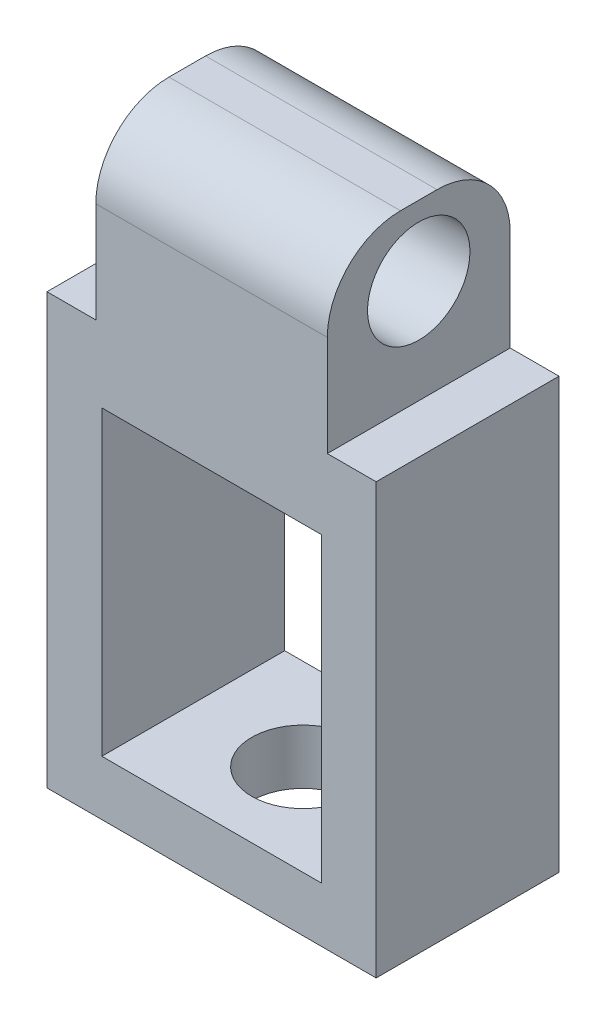
ISO-10303-21;
HEADER;
FILE_DESCRIPTION(('STEP AP214'),'2;1');
FILE_NAME('part.step','',(''),(''),'','','');
FILE_SCHEMA(('AUTOMOTIVE_DESIGN { 1 0 10303 214 1 1 1 1 }'));
ENDSEC;
DATA;
#1=APPLICATION_CONTEXT('core data for automotive mechanical design processes');
#2=APPLICATION_PROTOCOL_DEFINITION('international standard','automotive_design',2000,#1);
#3=PRODUCT_CONTEXT('',#1,'mechanical');
#4=PRODUCT('Part','Part','',(#3));
#5=PRODUCT_RELATED_PRODUCT_CATEGORY('part','',(#4));
#6=PRODUCT_DEFINITION_FORMATION('','',#4);
#7=PRODUCT_DEFINITION_CONTEXT('part definition',#1,'design');
#8=PRODUCT_DEFINITION('design','',#6,#7);
#9=PRODUCT_DEFINITION_SHAPE('','',#8);
#10=(LENGTH_UNIT() NAMED_UNIT(*) SI_UNIT(.MILLI.,.METRE.));
#11=(NAMED_UNIT(*) PLANE_ANGLE_UNIT() SI_UNIT($,.RADIAN.));
#12=(NAMED_UNIT(*) SI_UNIT($,.STERADIAN.) SOLID_ANGLE_UNIT());
#13=UNCERTAINTY_MEASURE_WITH_UNIT(LENGTH_MEASURE(1.E-05),#10,'distance_accuracy_value','');
#14=(GEOMETRIC_REPRESENTATION_CONTEXT(3) GLOBAL_UNCERTAINTY_ASSIGNED_CONTEXT((#13)) GLOBAL_UNIT_ASSIGNED_CONTEXT((#10,
#11,#12)) REPRESENTATION_CONTEXT('',''));
#15=CARTESIAN_POINT('',(0.,0.,0.));
#16=DIRECTION('',(0.,0.,1.));
#17=DIRECTION('',(1.,0.,0.));
#18=AXIS2_PLACEMENT_3D('',#15,#16,#17);
#19=CARTESIAN_POINT('',(-12.3630857788911,11.2393364752563,5.));
#20=DIRECTION('',(0.,0.,-1.));
#21=DIRECTION('',(-1.,0.,0.));
#22=AXIS2_PLACEMENT_3D('',#19,#20,#21);
#23=PLANE('',#22);
#24=DIRECTION('',(0.,1.,0.));
#25=VECTOR('',#24,1.);
#26=CARTESIAN_POINT('',(-6.03308577889106,11.2393364752563,5.));
#27=LINE('',#26,#25);
#28=CARTESIAN_POINT('',(-6.03308577889106,6.48933647525632,5.));
#29=VERTEX_POINT('',#28);
#30=CARTESIAN_POINT('',(-6.03308577889106,9.23933647525632,5.));
#31=VERTEX_POINT('',#30);
#32=EDGE_CURVE('E196',#29,#31,#27,.T.);
#33=ORIENTED_EDGE('',*,*,#32,.T.);
#34=DIRECTION('',(-1.,0.,0.));
#35=VECTOR('',#34,1.);
#36=CARTESIAN_POINT('',(-12.3630857788911,9.23933647525632,5.));
#37=LINE('',#36,#35);
#38=CARTESIAN_POINT('',(-12.3630857788911,9.23933647525632,5.));
#39=VERTEX_POINT('',#38);
#40=EDGE_CURVE('E11',#31,#39,#37,.T.);
#41=ORIENTED_EDGE('',*,*,#40,.T.);
#42=DIRECTION('',(0.,-1.,0.));
#43=VECTOR('',#42,1.);
#44=CARTESIAN_POINT('',(-12.3630857788911,6.48933647525632,5.));
#45=LINE('',#44,#43);
#46=CARTESIAN_POINT('',(-12.3630857788911,6.48933647525632,5.));
#47=VERTEX_POINT('',#46);
#48=EDGE_CURVE('E183',#39,#47,#45,.T.);
#49=ORIENTED_EDGE('',*,*,#48,.T.);
#50=DIRECTION('',(-1.,0.,0.));
#51=VECTOR('',#50,1.);
#52=CARTESIAN_POINT('',(-13.6980857788911,6.48933647525632,5.));
#53=LINE('',#52,#51);
#54=CARTESIAN_POINT('',(-13.6980857788911,6.48933647525632,5.));
#55=VERTEX_POINT('',#54);
#56=EDGE_CURVE('E185',#47,#55,#53,.T.);
#57=ORIENTED_EDGE('',*,*,#56,.T.);
#58=DIRECTION('',(0.,-1.,0.));
#59=VECTOR('',#58,1.);
#60=CARTESIAN_POINT('',(-13.6980857788911,-5.26066352474368,5.));
#61=LINE('',#60,#59);
#62=CARTESIAN_POINT('',(-13.6980857788911,-5.26066352474368,5.));
#63=VERTEX_POINT('',#62);
#64=EDGE_CURVE('E188',#55,#63,#61,.T.);
#65=ORIENTED_EDGE('',*,*,#64,.T.);
#66=DIRECTION('',(1.,0.,0.));
#67=VECTOR('',#66,1.);
#68=CARTESIAN_POINT('',(-4.69808577889106,-5.26066352474368,5.));
#69=LINE('',#68,#67);
#70=CARTESIAN_POINT('',(-4.69808577889106,-5.26066352474368,5.));
#71=VERTEX_POINT('',#70);
#72=EDGE_CURVE('E190',#63,#71,#69,.T.);
#73=ORIENTED_EDGE('',*,*,#72,.T.);
#74=DIRECTION('',(0.,1.,0.));
#75=VECTOR('',#74,1.);
#76=CARTESIAN_POINT('',(-4.69808577889106,6.48933647525632,5.));
#77=LINE('',#76,#75);
#78=CARTESIAN_POINT('',(-4.69808577889106,6.48933647525632,5.));
#79=VERTEX_POINT('',#78);
#80=EDGE_CURVE('E192',#71,#79,#77,.T.);
#81=ORIENTED_EDGE('',*,*,#80,.T.);
#82=DIRECTION('',(-1.,0.,0.));
#83=VECTOR('',#82,1.);
#84=CARTESIAN_POINT('',(-6.03308577889106,6.48933647525632,5.));
#85=LINE('',#84,#83);
#86=EDGE_CURVE('E194',#79,#29,#85,.T.);
#87=ORIENTED_EDGE('',*,*,#86,.T.);
#88=EDGE_LOOP('',(#33,#41,#49,#57,#65,#73,#81,#87));
#89=FACE_BOUND('',#88,.T.);
#90=DIRECTION('',(0.,-1.,0.));
#91=VECTOR('',#90,1.);
#92=CARTESIAN_POINT('',(-12.1980857788911,4.48933647525632,5.));
#93=LINE('',#92,#91);
#94=CARTESIAN_POINT('',(-12.1980857788911,4.48933647525632,5.));
#95=VERTEX_POINT('',#94);
#96=CARTESIAN_POINT('',(-12.1980857788911,-3.76066352474368,5.));
#97=VERTEX_POINT('',#96);
#98=EDGE_CURVE('E150',#95,#97,#93,.T.);
#99=ORIENTED_EDGE('',*,*,#98,.F.);
#100=DIRECTION('',(-1.,0.,0.));
#101=VECTOR('',#100,1.);
#102=CARTESIAN_POINT('',(-9.19808577889106,4.48933647525632,5.));
#103=LINE('',#102,#101);
#104=CARTESIAN_POINT('',(-6.19808577889106,4.48933647525632,5.));
#105=VERTEX_POINT('',#104);
#106=EDGE_CURVE('E139',#105,#95,#103,.T.);
#107=ORIENTED_EDGE('',*,*,#106,.F.);
#108=DIRECTION('',(0.,1.,0.));
#109=VECTOR('',#108,1.);
#110=CARTESIAN_POINT('',(-6.19808577889106,-3.76066352474368,5.));
#111=LINE('',#110,#109);
#112=CARTESIAN_POINT('',(-6.19808577889106,-3.76066352474368,5.));
#113=VERTEX_POINT('',#112);
#114=EDGE_CURVE('E165',#113,#105,#111,.T.);
#115=ORIENTED_EDGE('',*,*,#114,.F.);
#116=DIRECTION('',(1.,0.,0.));
#117=VECTOR('',#116,1.);
#118=CARTESIAN_POINT('',(-12.1980857788911,-3.76066352474368,5.));
#119=LINE('',#118,#117);
#120=EDGE_CURVE('E163',#97,#113,#119,.T.);
#121=ORIENTED_EDGE('',*,*,#120,.F.);
#122=EDGE_LOOP('',(#99,#107,#115,#121));
#123=FACE_BOUND('',#122,.T.);
#124=ADVANCED_FACE('F35',(#89,#123),#23,.F.);
#125=CARTESIAN_POINT('',(-12.3630857788911,11.2393364752563,0.));
#126=DIRECTION('',(0.,0.,-1.));
#127=DIRECTION('',(-1.,0.,0.));
#128=AXIS2_PLACEMENT_3D('',#125,#126,#127);
#129=PLANE('',#128);
#130=DIRECTION('',(0.,-1.,0.));
#131=VECTOR('',#130,1.);
#132=CARTESIAN_POINT('',(-12.3630857788911,6.48933647525632,0.));
#133=LINE('',#132,#131);
#134=CARTESIAN_POINT('',(-12.3630857788911,9.23933647525632,0.));
#135=VERTEX_POINT('',#134);
#136=CARTESIAN_POINT('',(-12.3630857788911,6.48933647525632,0.));
#137=VERTEX_POINT('',#136);
#138=EDGE_CURVE('E159',#135,#137,#133,.T.);
#139=ORIENTED_EDGE('',*,*,#138,.F.);
#140=DIRECTION('',(-1.,0.,0.));
#141=VECTOR('',#140,1.);
#142=CARTESIAN_POINT('',(-6.03308577889106,9.23933647525632,0.));
#143=LINE('',#142,#141);
#144=CARTESIAN_POINT('',(-6.03308577889106,9.23933647525632,0.));
#145=VERTEX_POINT('',#144);
#146=EDGE_CURVE('E58',#135,#145,#143,.F.);
#147=ORIENTED_EDGE('',*,*,#146,.T.);
#148=DIRECTION('',(0.,1.,0.));
#149=VECTOR('',#148,1.);
#150=CARTESIAN_POINT('',(-6.03308577889106,11.2393364752563,0.));
#151=LINE('',#150,#149);
#152=CARTESIAN_POINT('',(-6.03308577889106,6.48933647525632,0.));
#153=VERTEX_POINT('',#152);
#154=EDGE_CURVE('E186',#153,#145,#151,.T.);
#155=ORIENTED_EDGE('',*,*,#154,.F.);
#156=DIRECTION('',(-1.,0.,0.));
#157=VECTOR('',#156,1.);
#158=CARTESIAN_POINT('',(-6.03308577889106,6.48933647525632,0.));
#159=LINE('',#158,#157);
#160=CARTESIAN_POINT('',(-4.69808577889106,6.48933647525632,0.));
#161=VERTEX_POINT('',#160);
#162=EDGE_CURVE('E208',#161,#153,#159,.T.);
#163=ORIENTED_EDGE('',*,*,#162,.F.);
#164=DIRECTION('',(0.,1.,0.));
#165=VECTOR('',#164,1.);
#166=CARTESIAN_POINT('',(-4.69808577889106,6.48933647525632,0.));
#167=LINE('',#166,#165);
#168=CARTESIAN_POINT('',(-4.69808577889106,-5.26066352474368,0.));
#169=VERTEX_POINT('',#168);
#170=EDGE_CURVE('E206',#169,#161,#167,.T.);
#171=ORIENTED_EDGE('',*,*,#170,.F.);
#172=DIRECTION('',(1.,0.,0.));
#173=VECTOR('',#172,1.);
#174=CARTESIAN_POINT('',(-4.69808577889106,-5.26066352474368,0.));
#175=LINE('',#174,#173);
#176=CARTESIAN_POINT('',(-13.6980857788911,-5.26066352474368,0.));
#177=VERTEX_POINT('',#176);
#178=EDGE_CURVE('E204',#177,#169,#175,.T.);
#179=ORIENTED_EDGE('',*,*,#178,.F.);
#180=DIRECTION('',(0.,-1.,0.));
#181=VECTOR('',#180,1.);
#182=CARTESIAN_POINT('',(-13.6980857788911,-5.26066352474368,0.));
#183=LINE('',#182,#181);
#184=CARTESIAN_POINT('',(-13.6980857788911,6.48933647525632,0.));
#185=VERTEX_POINT('',#184);
#186=EDGE_CURVE('E202',#185,#177,#183,.T.);
#187=ORIENTED_EDGE('',*,*,#186,.F.);
#188=DIRECTION('',(-1.,0.,0.));
#189=VECTOR('',#188,1.);
#190=CARTESIAN_POINT('',(-13.6980857788911,6.48933647525632,0.));
#191=LINE('',#190,#189);
#192=EDGE_CURVE('E200',#137,#185,#191,.T.);
#193=ORIENTED_EDGE('',*,*,#192,.F.);
#194=EDGE_LOOP('',(#139,#147,#155,#163,#171,#179,#187,#193));
#195=FACE_BOUND('',#194,.T.);
#196=DIRECTION('',(-1.,0.,0.));
#197=VECTOR('',#196,1.);
#198=CARTESIAN_POINT('',(-9.19808577889106,4.48933647525632,0.));
#199=LINE('',#198,#197);
#200=CARTESIAN_POINT('',(-6.19808577889106,4.48933647525632,0.));
#201=VERTEX_POINT('',#200);
#202=CARTESIAN_POINT('',(-12.1980857788911,4.48933647525632,0.));
#203=VERTEX_POINT('',#202);
#204=EDGE_CURVE('E151',#201,#203,#199,.T.);
#205=ORIENTED_EDGE('',*,*,#204,.T.);
#206=DIRECTION('',(0.,-1.,0.));
#207=VECTOR('',#206,1.);
#208=CARTESIAN_POINT('',(-12.1980857788911,4.48933647525632,0.));
#209=LINE('',#208,#207);
#210=CARTESIAN_POINT('',(-12.1980857788911,-3.76066352474368,0.));
#211=VERTEX_POINT('',#210);
#212=EDGE_CURVE('E157',#203,#211,#209,.T.);
#213=ORIENTED_EDGE('',*,*,#212,.T.);
#214=DIRECTION('',(1.,0.,0.));
#215=VECTOR('',#214,1.);
#216=CARTESIAN_POINT('',(-12.1980857788911,-3.76066352474368,0.));
#217=LINE('',#216,#215);
#218=CARTESIAN_POINT('',(-6.19808577889106,-3.76066352474368,0.));
#219=VERTEX_POINT('',#218);
#220=EDGE_CURVE('E171',#211,#219,#217,.T.);
#221=ORIENTED_EDGE('',*,*,#220,.T.);
#222=DIRECTION('',(0.,1.,0.));
#223=VECTOR('',#222,1.);
#224=CARTESIAN_POINT('',(-6.19808577889106,-3.76066352474368,0.));
#225=LINE('',#224,#223);
#226=EDGE_CURVE('E175',#219,#201,#225,.T.);
#227=ORIENTED_EDGE('',*,*,#226,.T.);
#228=EDGE_LOOP('',(#205,#213,#221,#227));
#229=FACE_BOUND('',#228,.T.);
#230=ADVANCED_FACE('F262',(#195,#229),#129,.T.);
#231=CARTESIAN_POINT('',(-12.3630857788911,6.48933647525632,5.));
#232=DIRECTION('',(1.,0.,0.));
#233=DIRECTION('',(0.,0.,-1.));
#234=AXIS2_PLACEMENT_3D('',#231,#232,#233);
#235=PLANE('',#234);
#236=CARTESIAN_POINT('',(-12.3630857788911,9.32350258781156,2.5));
#237=DIRECTION('',(1.,0.,0.));
#238=DIRECTION('',(0.,0.,-1.));
#239=AXIS2_PLACEMENT_3D('',#236,#237,#238);
#240=CIRCLE('',#239,1.4);
#241=CARTESIAN_POINT('',(-12.3630857788911,9.32350258781156,1.1));
#242=VERTEX_POINT('',#241);
#243=EDGE_CURVE('E172',#242,#242,#240,.T.);
#244=ORIENTED_EDGE('',*,*,#243,.T.);
#245=EDGE_LOOP('',(#244));
#246=FACE_BOUND('',#245,.T.);
#247=DIRECTION('',(0.,0.,-1.));
#248=VECTOR('',#247,1.);
#249=CARTESIAN_POINT('',(-12.3630857788911,11.2393364752563,5.));
#250=LINE('',#249,#248);
#251=CARTESIAN_POINT('',(-12.3630857788911,11.2393364752563,3.));
#252=VERTEX_POINT('',#251);
#253=CARTESIAN_POINT('',(-12.3630857788911,11.2393364752563,2.));
#254=VERTEX_POINT('',#253);
#255=EDGE_CURVE('E198',#252,#254,#250,.T.);
#256=ORIENTED_EDGE('',*,*,#255,.T.);
#257=CARTESIAN_POINT('',(-12.3630857788911,9.23933647525632,2.));
#258=DIRECTION('',(1.,0.,0.));
#259=DIRECTION('',(0.,0.,-1.));
#260=AXIS2_PLACEMENT_3D('',#257,#258,#259);
#261=CIRCLE('',#260,2.);
#262=EDGE_CURVE('E246',#254,#135,#261,.F.);
#263=ORIENTED_EDGE('',*,*,#262,.T.);
#264=ORIENTED_EDGE('',*,*,#138,.T.);
#265=DIRECTION('',(0.,0.,-1.));
#266=VECTOR('',#265,1.);
#267=CARTESIAN_POINT('',(-12.3630857788911,6.48933647525632,5.));
#268=LINE('',#267,#266);
#269=EDGE_CURVE('E231',#47,#137,#268,.T.);
#270=ORIENTED_EDGE('',*,*,#269,.F.);
#271=ORIENTED_EDGE('',*,*,#48,.F.);
#272=CARTESIAN_POINT('',(-12.3630857788911,9.23933647525632,3.));
#273=DIRECTION('',(1.,0.,0.));
#274=DIRECTION('',(0.,0.,-1.));
#275=AXIS2_PLACEMENT_3D('',#272,#273,#274);
#276=CIRCLE('',#275,2.);
#277=EDGE_CURVE('E244',#39,#252,#276,.F.);
#278=ORIENTED_EDGE('',*,*,#277,.T.);
#279=EDGE_LOOP('',(#256,#263,#264,#270,#271,#278));
#280=FACE_BOUND('',#279,.T.);
#281=ADVANCED_FACE('F259',(#246,#280),#235,.F.);
#282=CARTESIAN_POINT('',(-13.6980857788911,6.48933647525632,5.));
#283=DIRECTION('',(0.,-1.,0.));
#284=DIRECTION('',(0.,0.,-1.));
#285=AXIS2_PLACEMENT_3D('',#282,#283,#284);
#286=PLANE('',#285);
#287=ORIENTED_EDGE('',*,*,#192,.T.);
#288=DIRECTION('',(0.,0.,-1.));
#289=VECTOR('',#288,1.);
#290=CARTESIAN_POINT('',(-13.6980857788911,6.48933647525632,5.));
#291=LINE('',#290,#289);
#292=EDGE_CURVE('E228',#55,#185,#291,.T.);
#293=ORIENTED_EDGE('',*,*,#292,.F.);
#294=ORIENTED_EDGE('',*,*,#56,.F.);
#295=ORIENTED_EDGE('',*,*,#269,.T.);
#296=EDGE_LOOP('',(#287,#293,#294,#295));
#297=FACE_BOUND('',#296,.T.);
#298=ADVANCED_FACE('F269',(#297),#286,.F.);
#299=CARTESIAN_POINT('',(-13.6980857788911,-5.26066352474368,5.));
#300=DIRECTION('',(1.,0.,0.));
#301=DIRECTION('',(0.,1.,0.));
#302=AXIS2_PLACEMENT_3D('',#299,#300,#301);
#303=PLANE('',#302);
#304=ORIENTED_EDGE('',*,*,#186,.T.);
#305=DIRECTION('',(0.,0.,-1.));
#306=VECTOR('',#305,1.);
#307=CARTESIAN_POINT('',(-13.6980857788911,-5.26066352474368,5.));
#308=LINE('',#307,#306);
#309=EDGE_CURVE('E225',#63,#177,#308,.T.);
#310=ORIENTED_EDGE('',*,*,#309,.F.);
#311=ORIENTED_EDGE('',*,*,#64,.F.);
#312=ORIENTED_EDGE('',*,*,#292,.T.);
#313=EDGE_LOOP('',(#304,#310,#311,#312));
#314=FACE_BOUND('',#313,.T.);
#315=ADVANCED_FACE('F304',(#314),#303,.F.);
#316=CARTESIAN_POINT('',(-4.69808577889106,-5.26066352474368,5.));
#317=DIRECTION('',(0.,1.,0.));
#318=DIRECTION('',(-1.,0.,0.));
#319=AXIS2_PLACEMENT_3D('',#316,#317,#318);
#320=PLANE('',#319);
#321=CARTESIAN_POINT('',(-9.19808577889106,-5.26066352474368,2.5));
#322=DIRECTION('',(0.,-1.,0.));
#323=DIRECTION('',(1.,0.,0.));
#324=AXIS2_PLACEMENT_3D('',#321,#322,#323);
#325=CIRCLE('',#324,1.4);
#326=CARTESIAN_POINT('',(-7.79808577889106,-5.26066352474368,2.5));
#327=VERTEX_POINT('',#326);
#328=EDGE_CURVE('E239',#327,#327,#325,.T.);
#329=ORIENTED_EDGE('',*,*,#328,.F.);
#330=EDGE_LOOP('',(#329));
#331=FACE_BOUND('',#330,.T.);
#332=ORIENTED_EDGE('',*,*,#178,.T.);
#333=DIRECTION('',(0.,0.,-1.));
#334=VECTOR('',#333,1.);
#335=CARTESIAN_POINT('',(-4.69808577889106,-5.26066352474368,5.));
#336=LINE('',#335,#334);
#337=EDGE_CURVE('E222',#71,#169,#336,.T.);
#338=ORIENTED_EDGE('',*,*,#337,.F.);
#339=ORIENTED_EDGE('',*,*,#72,.F.);
#340=ORIENTED_EDGE('',*,*,#309,.T.);
#341=EDGE_LOOP('',(#332,#338,#339,#340));
#342=FACE_BOUND('',#341,.T.);
#343=ADVANCED_FACE('F300',(#331,#342),#320,.F.);
#344=CARTESIAN_POINT('',(-4.69808577889106,6.48933647525632,5.));
#345=DIRECTION('',(-1.,0.,0.));
#346=DIRECTION('',(0.,-1.,0.));
#347=AXIS2_PLACEMENT_3D('',#344,#345,#346);
#348=PLANE('',#347);
#349=ORIENTED_EDGE('',*,*,#170,.T.);
#350=DIRECTION('',(0.,0.,-1.));
#351=VECTOR('',#350,1.);
#352=CARTESIAN_POINT('',(-4.69808577889106,6.48933647525632,5.));
#353=LINE('',#352,#351);
#354=EDGE_CURVE('E219',#79,#161,#353,.T.);
#355=ORIENTED_EDGE('',*,*,#354,.F.);
#356=ORIENTED_EDGE('',*,*,#80,.F.);
#357=ORIENTED_EDGE('',*,*,#337,.T.);
#358=EDGE_LOOP('',(#349,#355,#356,#357));
#359=FACE_BOUND('',#358,.T.);
#360=ADVANCED_FACE('F296',(#359),#348,.F.);
#361=CARTESIAN_POINT('',(-6.03308577889106,6.48933647525632,5.));
#362=DIRECTION('',(0.,-1.,0.));
#363=DIRECTION('',(1.,0.,0.));
#364=AXIS2_PLACEMENT_3D('',#361,#362,#363);
#365=PLANE('',#364);
#366=ORIENTED_EDGE('',*,*,#162,.T.);
#367=DIRECTION('',(0.,0.,-1.));
#368=VECTOR('',#367,1.);
#369=CARTESIAN_POINT('',(-6.03308577889106,6.48933647525632,5.));
#370=LINE('',#369,#368);
#371=EDGE_CURVE('E216',#29,#153,#370,.T.);
#372=ORIENTED_EDGE('',*,*,#371,.F.);
#373=ORIENTED_EDGE('',*,*,#86,.F.);
#374=ORIENTED_EDGE('',*,*,#354,.T.);
#375=EDGE_LOOP('',(#366,#372,#373,#374));
#376=FACE_BOUND('',#375,.T.);
#377=ADVANCED_FACE('F292',(#376),#365,.F.);
#378=CARTESIAN_POINT('',(-6.03308577889106,11.2393364752563,5.));
#379=DIRECTION('',(-1.,0.,0.));
#380=DIRECTION('',(0.,-1.,0.));
#381=AXIS2_PLACEMENT_3D('',#378,#379,#380);
#382=PLANE('',#381);
#383=CARTESIAN_POINT('',(-6.03308577889106,9.32350258781156,2.5));
#384=DIRECTION('',(1.,0.,0.));
#385=DIRECTION('',(0.,0.,-1.));
#386=AXIS2_PLACEMENT_3D('',#383,#384,#385);
#387=CIRCLE('',#386,1.4);
#388=CARTESIAN_POINT('',(-6.03308577889106,9.32350258781156,1.1));
#389=VERTEX_POINT('',#388);
#390=EDGE_CURVE('E238',#389,#389,#387,.T.);
#391=ORIENTED_EDGE('',*,*,#390,.F.);
#392=EDGE_LOOP('',(#391));
#393=FACE_BOUND('',#392,.T.);
#394=ORIENTED_EDGE('',*,*,#154,.T.);
#395=CARTESIAN_POINT('',(-6.03308577889106,9.23933647525632,2.));
#396=DIRECTION('',(-1.,0.,0.));
#397=DIRECTION('',(0.,-1.,0.));
#398=AXIS2_PLACEMENT_3D('',#395,#396,#397);
#399=CIRCLE('',#398,2.);
#400=CARTESIAN_POINT('',(-6.03308577889106,11.2393364752563,2.));
#401=VERTEX_POINT('',#400);
#402=EDGE_CURVE('E43',#145,#401,#399,.F.);
#403=ORIENTED_EDGE('',*,*,#402,.T.);
#404=DIRECTION('',(0.,0.,-1.));
#405=VECTOR('',#404,1.);
#406=CARTESIAN_POINT('',(-6.03308577889106,11.2393364752563,5.));
#407=LINE('',#406,#405);
#408=CARTESIAN_POINT('',(-6.03308577889106,11.2393364752563,3.));
#409=VERTEX_POINT('',#408);
#410=EDGE_CURVE('E213',#409,#401,#407,.T.);
#411=ORIENTED_EDGE('',*,*,#410,.F.);
#412=CARTESIAN_POINT('',(-6.03308577889106,9.23933647525632,3.));
#413=DIRECTION('',(-1.,0.,0.));
#414=DIRECTION('',(0.,-1.,0.));
#415=AXIS2_PLACEMENT_3D('',#412,#413,#414);
#416=CIRCLE('',#415,2.);
#417=EDGE_CURVE('E50',#409,#31,#416,.F.);
#418=ORIENTED_EDGE('',*,*,#417,.T.);
#419=ORIENTED_EDGE('',*,*,#32,.F.);
#420=ORIENTED_EDGE('',*,*,#371,.T.);
#421=EDGE_LOOP('',(#394,#403,#411,#418,#419,#420));
#422=FACE_BOUND('',#421,.T.);
#423=ADVANCED_FACE('F250',(#393,#422),#382,.F.);
#424=CARTESIAN_POINT('',(-12.3630857788911,11.2393364752563,5.));
#425=DIRECTION('',(0.,-1.,0.));
#426=DIRECTION('',(1.,0.,0.));
#427=AXIS2_PLACEMENT_3D('',#424,#425,#426);
#428=PLANE('',#427);
#429=ORIENTED_EDGE('',*,*,#410,.T.);
#430=DIRECTION('',(-1.,0.,0.));
#431=VECTOR('',#430,1.);
#432=CARTESIAN_POINT('',(-12.3630857788911,11.2393364752563,2.));
#433=LINE('',#432,#431);
#434=EDGE_CURVE('E241',#401,#254,#433,.T.);
#435=ORIENTED_EDGE('',*,*,#434,.T.);
#436=ORIENTED_EDGE('',*,*,#255,.F.);
#437=DIRECTION('',(-1.,0.,0.));
#438=VECTOR('',#437,1.);
#439=CARTESIAN_POINT('',(-12.3630857788911,11.2393364752563,3.));
#440=LINE('',#439,#438);
#441=EDGE_CURVE('E234',#252,#409,#440,.F.);
#442=ORIENTED_EDGE('',*,*,#441,.T.);
#443=EDGE_LOOP('',(#429,#435,#436,#442));
#444=FACE_BOUND('',#443,.T.);
#445=ADVANCED_FACE('F254',(#444),#428,.F.);
#446=CARTESIAN_POINT('',(-12.1980857788911,4.48933647525632,5.));
#447=DIRECTION('',(1.,0.,0.));
#448=DIRECTION('',(0.,1.,0.));
#449=AXIS2_PLACEMENT_3D('',#446,#447,#448);
#450=PLANE('',#449);
#451=ORIENTED_EDGE('',*,*,#212,.F.);
#452=DIRECTION('',(0.,0.,-1.));
#453=VECTOR('',#452,1.);
#454=CARTESIAN_POINT('',(-12.1980857788911,4.48933647525632,5.));
#455=LINE('',#454,#453);
#456=EDGE_CURVE('E143',#95,#203,#455,.T.);
#457=ORIENTED_EDGE('',*,*,#456,.F.);
#458=ORIENTED_EDGE('',*,*,#98,.T.);
#459=DIRECTION('',(0.,0.,-1.));
#460=VECTOR('',#459,1.);
#461=CARTESIAN_POINT('',(-12.1980857788911,-3.76066352474368,5.));
#462=LINE('',#461,#460);
#463=EDGE_CURVE('E160',#97,#211,#462,.T.);
#464=ORIENTED_EDGE('',*,*,#463,.T.);
#465=EDGE_LOOP('',(#451,#457,#458,#464));
#466=FACE_BOUND('',#465,.T.);
#467=ADVANCED_FACE('F154',(#466),#450,.T.);
#468=CARTESIAN_POINT('',(-12.1980857788911,-3.76066352474368,5.));
#469=DIRECTION('',(0.,1.,0.));
#470=DIRECTION('',(0.,0.,1.));
#471=AXIS2_PLACEMENT_3D('',#468,#469,#470);
#472=PLANE('',#471);
#473=CARTESIAN_POINT('',(-9.19808577889106,-3.76066352474368,2.5));
#474=DIRECTION('',(0.,1.,0.));
#475=DIRECTION('',(0.,0.,1.));
#476=AXIS2_PLACEMENT_3D('',#473,#474,#475);
#477=CIRCLE('',#476,1.4);
#478=CARTESIAN_POINT('',(-9.19808577889106,-3.76066352474368,3.9));
#479=VERTEX_POINT('',#478);
#480=EDGE_CURVE('E235',#479,#479,#477,.T.);
#481=ORIENTED_EDGE('',*,*,#480,.F.);
#482=EDGE_LOOP('',(#481));
#483=FACE_BOUND('',#482,.T.);
#484=ORIENTED_EDGE('',*,*,#220,.F.);
#485=ORIENTED_EDGE('',*,*,#463,.F.);
#486=ORIENTED_EDGE('',*,*,#120,.T.);
#487=DIRECTION('',(0.,0.,-1.));
#488=VECTOR('',#487,1.);
#489=CARTESIAN_POINT('',(-6.19808577889106,-3.76066352474368,5.));
#490=LINE('',#489,#488);
#491=EDGE_CURVE('E180',#113,#219,#490,.T.);
#492=ORIENTED_EDGE('',*,*,#491,.T.);
#493=EDGE_LOOP('',(#484,#485,#486,#492));
#494=FACE_BOUND('',#493,.T.);
#495=ADVANCED_FACE('F349',(#483,#494),#472,.T.);
#496=CARTESIAN_POINT('',(-6.19808577889106,-3.76066352474368,5.));
#497=DIRECTION('',(-1.,0.,0.));
#498=DIRECTION('',(0.,0.,1.));
#499=AXIS2_PLACEMENT_3D('',#496,#497,#498);
#500=PLANE('',#499);
#501=ORIENTED_EDGE('',*,*,#226,.F.);
#502=ORIENTED_EDGE('',*,*,#491,.F.);
#503=ORIENTED_EDGE('',*,*,#114,.T.);
#504=DIRECTION('',(0.,0.,-1.));
#505=VECTOR('',#504,1.);
#506=CARTESIAN_POINT('',(-6.19808577889106,4.48933647525632,5.));
#507=LINE('',#506,#505);
#508=EDGE_CURVE('E145',#105,#201,#507,.T.);
#509=ORIENTED_EDGE('',*,*,#508,.T.);
#510=EDGE_LOOP('',(#501,#502,#503,#509));
#511=FACE_BOUND('',#510,.T.);
#512=ADVANCED_FACE('F347',(#511),#500,.T.);
#513=CARTESIAN_POINT('',(-9.19808577889106,4.48933647525632,5.));
#514=DIRECTION('',(0.,-1.,0.));
#515=DIRECTION('',(0.,0.,-1.));
#516=AXIS2_PLACEMENT_3D('',#513,#514,#515);
#517=PLANE('',#516);
#518=ORIENTED_EDGE('',*,*,#204,.F.);
#519=ORIENTED_EDGE('',*,*,#508,.F.);
#520=ORIENTED_EDGE('',*,*,#106,.T.);
#521=ORIENTED_EDGE('',*,*,#456,.T.);
#522=EDGE_LOOP('',(#518,#519,#520,#521));
#523=FACE_BOUND('',#522,.T.);
#524=ADVANCED_FACE('F142',(#523),#517,.T.);
#525=CARTESIAN_POINT('',(-14.0330857788911,9.32350258781156,2.5));
#526=DIRECTION('',(1.,0.,0.));
#527=DIRECTION('',(0.,0.,-1.));
#528=AXIS2_PLACEMENT_3D('',#525,#526,#527);
#529=CYLINDRICAL_SURFACE('',#528,1.4);
#530=ORIENTED_EDGE('',*,*,#390,.T.);
#531=EDGE_LOOP('',(#530));
#532=FACE_BOUND('',#531,.T.);
#533=ORIENTED_EDGE('',*,*,#243,.F.);
#534=EDGE_LOOP('',(#533));
#535=FACE_BOUND('',#534,.T.);
#536=ADVANCED_FACE('F336',(#532,#535),#529,.F.);
#537=CARTESIAN_POINT('',(-9.19808577889106,0.739336475256323,2.5));
#538=DIRECTION('',(0.,-1.,0.));
#539=DIRECTION('',(1.,0.,0.));
#540=AXIS2_PLACEMENT_3D('',#537,#538,#539);
#541=CYLINDRICAL_SURFACE('',#540,1.4);
#542=ORIENTED_EDGE('',*,*,#480,.T.);
#543=EDGE_LOOP('',(#542));
#544=FACE_BOUND('',#543,.T.);
#545=ORIENTED_EDGE('',*,*,#328,.T.);
#546=EDGE_LOOP('',(#545));
#547=FACE_BOUND('',#546,.T.);
#548=ADVANCED_FACE('F278',(#544,#547),#541,.F.);
#549=CARTESIAN_POINT('',(-12.3630857788911,9.23933647525632,2.));
#550=DIRECTION('',(1.,0.,0.));
#551=DIRECTION('',(0.,1.,0.));
#552=AXIS2_PLACEMENT_3D('',#549,#550,#551);
#553=CYLINDRICAL_SURFACE('',#552,2.);
#554=ORIENTED_EDGE('',*,*,#402,.F.);
#555=ORIENTED_EDGE('',*,*,#146,.F.);
#556=ORIENTED_EDGE('',*,*,#262,.F.);
#557=ORIENTED_EDGE('',*,*,#434,.F.);
#558=EDGE_LOOP('',(#554,#555,#556,#557));
#559=FACE_BOUND('',#558,.T.);
#560=ADVANCED_FACE('F257',(#559),#553,.T.);
#561=CARTESIAN_POINT('',(-12.3630857788911,9.23933647525632,3.));
#562=DIRECTION('',(-1.,0.,0.));
#563=DIRECTION('',(0.,-1.,0.));
#564=AXIS2_PLACEMENT_3D('',#561,#562,#563);
#565=CYLINDRICAL_SURFACE('',#564,2.);
#566=ORIENTED_EDGE('',*,*,#417,.F.);
#567=ORIENTED_EDGE('',*,*,#441,.F.);
#568=ORIENTED_EDGE('',*,*,#277,.F.);
#569=ORIENTED_EDGE('',*,*,#40,.F.);
#570=EDGE_LOOP('',(#566,#567,#568,#569));
#571=FACE_BOUND('',#570,.T.);
#572=ADVANCED_FACE('F37',(#571),#565,.T.);
#573=CLOSED_SHELL('',(#124,#230,#281,#298,#315,#343,#360,#377,#423,#445,#467,#495,#512,#524,
#536,#548,#560,#572));
#574=MANIFOLD_SOLID_BREP('B2',#573);
#575=ADVANCED_BREP_SHAPE_REPRESENTATION('',(#18,#574),#14);
#576=SHAPE_DEFINITION_REPRESENTATION(#9,#575);
ENDSEC;
END-ISO-10303-21;
